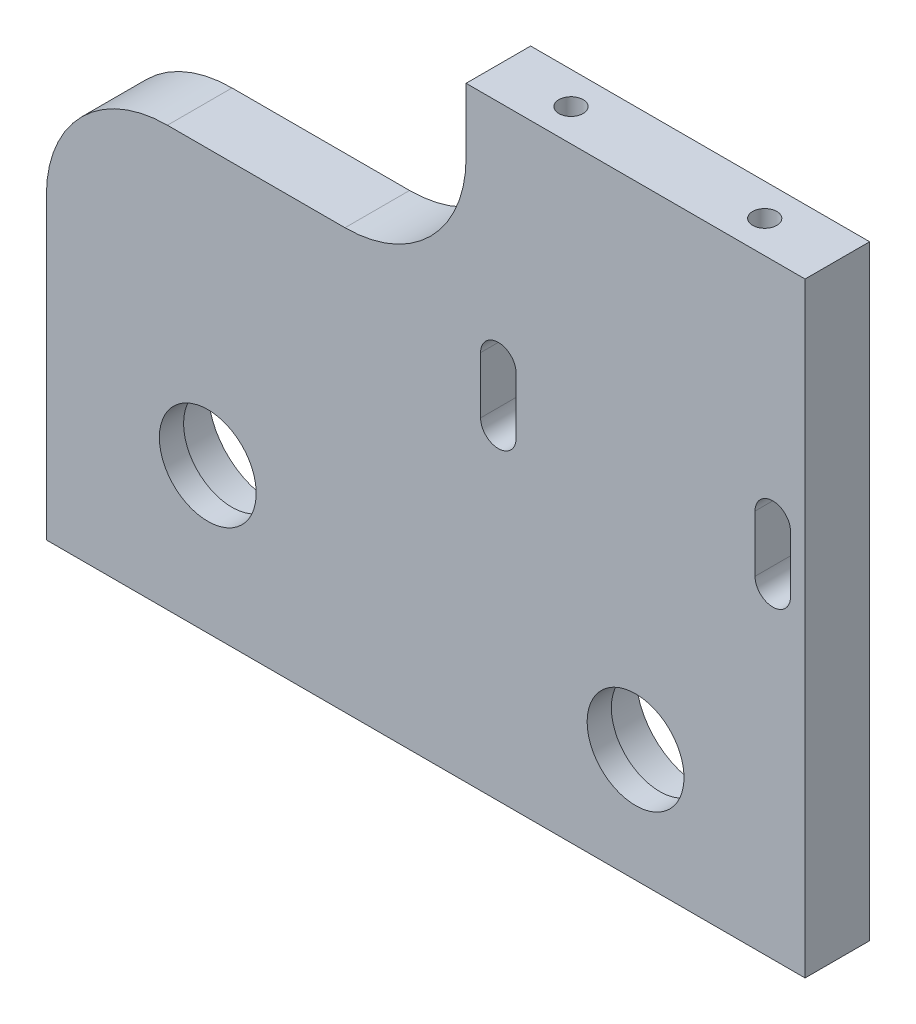
ISO-10303-21;
HEADER;
FILE_DESCRIPTION(('STEP AP214'),'2;1');
FILE_NAME('part.step','',(''),(''),'','','');
FILE_SCHEMA(('AUTOMOTIVE_DESIGN { 1 0 10303 214 1 1 1 1 }'));
ENDSEC;
DATA;
#1=APPLICATION_CONTEXT('core data for automotive mechanical design processes');
#2=APPLICATION_PROTOCOL_DEFINITION('international standard','automotive_design',2000,#1);
#3=PRODUCT_CONTEXT('',#1,'mechanical');
#4=PRODUCT('Part','Part','',(#3));
#5=PRODUCT_RELATED_PRODUCT_CATEGORY('part','',(#4));
#6=PRODUCT_DEFINITION_FORMATION('','',#4);
#7=PRODUCT_DEFINITION_CONTEXT('part definition',#1,'design');
#8=PRODUCT_DEFINITION('design','',#6,#7);
#9=PRODUCT_DEFINITION_SHAPE('','',#8);
#10=(LENGTH_UNIT() NAMED_UNIT(*) SI_UNIT(.MILLI.,.METRE.));
#11=(NAMED_UNIT(*) PLANE_ANGLE_UNIT() SI_UNIT($,.RADIAN.));
#12=(NAMED_UNIT(*) SI_UNIT($,.STERADIAN.) SOLID_ANGLE_UNIT());
#13=UNCERTAINTY_MEASURE_WITH_UNIT(LENGTH_MEASURE(1.E-05),#10,'distance_accuracy_value','');
#14=(GEOMETRIC_REPRESENTATION_CONTEXT(3) GLOBAL_UNCERTAINTY_ASSIGNED_CONTEXT((#13)) GLOBAL_UNIT_ASSIGNED_CONTEXT((#10,
#11,#12)) REPRESENTATION_CONTEXT('',''));
#15=CARTESIAN_POINT('',(0.,0.,0.));
#16=DIRECTION('',(0.,0.,1.));
#17=DIRECTION('',(1.,0.,0.));
#18=AXIS2_PLACEMENT_3D('',#15,#16,#17);
#19=CARTESIAN_POINT('',(0.,0.,8.));
#20=DIRECTION('',(1.,0.,0.));
#21=DIRECTION('',(0.,1.,0.));
#22=AXIS2_PLACEMENT_3D('',#19,#20,#21);
#23=PLANE('',#22);
#24=DIRECTION('',(0.,-1.,0.));
#25=VECTOR('',#24,1.);
#26=CARTESIAN_POINT('',(0.,0.,8.));
#27=LINE('',#26,#25);
#28=CARTESIAN_POINT('',(0.,37.,8.));
#29=VERTEX_POINT('',#28);
#30=CARTESIAN_POINT('',(0.,0.,8.));
#31=VERTEX_POINT('',#30);
#32=EDGE_CURVE('E261',#29,#31,#27,.T.);
#33=ORIENTED_EDGE('',*,*,#32,.F.);
#34=DIRECTION('',(0.,0.,-1.));
#35=VECTOR('',#34,1.);
#36=CARTESIAN_POINT('',(0.,37.,8.));
#37=LINE('',#36,#35);
#38=CARTESIAN_POINT('',(0.,37.,0.));
#39=VERTEX_POINT('',#38);
#40=EDGE_CURVE('E296',#29,#39,#37,.T.);
#41=ORIENTED_EDGE('',*,*,#40,.T.);
#42=DIRECTION('',(0.,-1.,0.));
#43=VECTOR('',#42,1.);
#44=CARTESIAN_POINT('',(0.,0.,0.));
#45=LINE('',#44,#43);
#46=CARTESIAN_POINT('',(0.,0.,0.));
#47=VERTEX_POINT('',#46);
#48=EDGE_CURVE('E252',#39,#47,#45,.T.);
#49=ORIENTED_EDGE('',*,*,#48,.T.);
#50=DIRECTION('',(0.,0.,-1.));
#51=VECTOR('',#50,1.);
#52=CARTESIAN_POINT('',(0.,0.,8.));
#53=LINE('',#52,#51);
#54=EDGE_CURVE('E293',#31,#47,#53,.T.);
#55=ORIENTED_EDGE('',*,*,#54,.F.);
#56=EDGE_LOOP('',(#33,#41,#49,#55));
#57=FACE_BOUND('',#56,.T.);
#58=ADVANCED_FACE('F41',(#57),#23,.F.);
#59=CARTESIAN_POINT('',(0.,0.,8.));
#60=DIRECTION('',(0.,1.,0.));
#61=DIRECTION('',(0.,0.,1.));
#62=AXIS2_PLACEMENT_3D('',#59,#60,#61);
#63=PLANE('',#62);
#64=CARTESIAN_POINT('',(6.00000000000001,0.,4.));
#65=DIRECTION('',(0.,-1.,0.));
#66=DIRECTION('',(0.,0.,-1.));
#67=AXIS2_PLACEMENT_3D('',#64,#65,#66);
#68=CIRCLE('',#67,1.5);
#69=CARTESIAN_POINT('',(6.00000000000001,0.,2.5));
#70=VERTEX_POINT('',#69);
#71=EDGE_CURVE('E585',#70,#70,#68,.T.);
#72=ORIENTED_EDGE('',*,*,#71,.F.);
#73=EDGE_LOOP('',(#72));
#74=FACE_BOUND('',#73,.T.);
#75=CARTESIAN_POINT('',(88.,0.,4.));
#76=DIRECTION('',(0.,-1.,0.));
#77=DIRECTION('',(0.,0.,-1.));
#78=AXIS2_PLACEMENT_3D('',#75,#76,#77);
#79=CIRCLE('',#78,1.5);
#80=CARTESIAN_POINT('',(88.,0.,2.5));
#81=VERTEX_POINT('',#80);
#82=EDGE_CURVE('E595',#81,#81,#79,.T.);
#83=ORIENTED_EDGE('',*,*,#82,.F.);
#84=EDGE_LOOP('',(#83));
#85=FACE_BOUND('',#84,.T.);
#86=DIRECTION('',(1.,0.,0.));
#87=VECTOR('',#86,1.);
#88=CARTESIAN_POINT('',(0.,0.,0.));
#89=LINE('',#88,#87);
#90=CARTESIAN_POINT('',(94.,0.,0.));
#91=VERTEX_POINT('',#90);
#92=EDGE_CURVE('E276',#47,#91,#89,.T.);
#93=ORIENTED_EDGE('',*,*,#92,.T.);
#94=DIRECTION('',(0.,0.,-1.));
#95=VECTOR('',#94,1.);
#96=CARTESIAN_POINT('',(94.,0.,8.));
#97=LINE('',#96,#95);
#98=CARTESIAN_POINT('',(94.,0.,8.));
#99=VERTEX_POINT('',#98);
#100=EDGE_CURVE('E290',#99,#91,#97,.T.);
#101=ORIENTED_EDGE('',*,*,#100,.F.);
#102=DIRECTION('',(1.,0.,0.));
#103=VECTOR('',#102,1.);
#104=CARTESIAN_POINT('',(0.,0.,8.));
#105=LINE('',#104,#103);
#106=EDGE_CURVE('E263',#31,#99,#105,.T.);
#107=ORIENTED_EDGE('',*,*,#106,.F.);
#108=ORIENTED_EDGE('',*,*,#54,.T.);
#109=EDGE_LOOP('',(#93,#101,#107,#108));
#110=FACE_BOUND('',#109,.T.);
#111=ADVANCED_FACE('F330',(#74,#85,#110),#63,.F.);
#112=CARTESIAN_POINT('',(94.,0.,8.));
#113=DIRECTION('',(-1.,0.,0.));
#114=DIRECTION('',(0.,0.,1.));
#115=AXIS2_PLACEMENT_3D('',#112,#113,#114);
#116=PLANE('',#115);
#117=DIRECTION('',(0.,1.,0.));
#118=VECTOR('',#117,1.);
#119=CARTESIAN_POINT('',(94.,0.,0.));
#120=LINE('',#119,#118);
#121=CARTESIAN_POINT('',(94.,75.,0.));
#122=VERTEX_POINT('',#121);
#123=EDGE_CURVE('E278',#91,#122,#120,.T.);
#124=ORIENTED_EDGE('',*,*,#123,.T.);
#125=DIRECTION('',(0.,0.,-1.));
#126=VECTOR('',#125,1.);
#127=CARTESIAN_POINT('',(94.,75.,8.));
#128=LINE('',#127,#126);
#129=CARTESIAN_POINT('',(94.,75.,8.));
#130=VERTEX_POINT('',#129);
#131=EDGE_CURVE('E287',#130,#122,#128,.T.);
#132=ORIENTED_EDGE('',*,*,#131,.F.);
#133=DIRECTION('',(0.,1.,0.));
#134=VECTOR('',#133,1.);
#135=CARTESIAN_POINT('',(94.,0.,8.));
#136=LINE('',#135,#134);
#137=EDGE_CURVE('E266',#99,#130,#136,.T.);
#138=ORIENTED_EDGE('',*,*,#137,.F.);
#139=ORIENTED_EDGE('',*,*,#100,.T.);
#140=EDGE_LOOP('',(#124,#132,#138,#139));
#141=FACE_BOUND('',#140,.T.);
#142=ADVANCED_FACE('F336',(#141),#116,.F.);
#143=CARTESIAN_POINT('',(52.,75.,8.));
#144=DIRECTION('',(0.,-1.,0.));
#145=DIRECTION('',(0.,0.,-1.));
#146=AXIS2_PLACEMENT_3D('',#143,#144,#145);
#147=PLANE('',#146);
#148=CARTESIAN_POINT('',(61.,75.,4.));
#149=DIRECTION('',(0.,1.,0.));
#150=DIRECTION('',(0.,0.,1.));
#151=AXIS2_PLACEMENT_3D('',#148,#149,#150);
#152=CIRCLE('',#151,1.5);
#153=CARTESIAN_POINT('',(61.,75.,5.5));
#154=VERTEX_POINT('',#153);
#155=EDGE_CURVE('E599',#154,#154,#152,.T.);
#156=ORIENTED_EDGE('',*,*,#155,.F.);
#157=EDGE_LOOP('',(#156));
#158=FACE_BOUND('',#157,.T.);
#159=CARTESIAN_POINT('',(85.,75.,4.));
#160=DIRECTION('',(0.,1.,0.));
#161=DIRECTION('',(0.,0.,1.));
#162=AXIS2_PLACEMENT_3D('',#159,#160,#161);
#163=CIRCLE('',#162,1.5);
#164=CARTESIAN_POINT('',(85.,75.,5.5));
#165=VERTEX_POINT('',#164);
#166=EDGE_CURVE('E188',#165,#165,#163,.T.);
#167=ORIENTED_EDGE('',*,*,#166,.F.);
#168=EDGE_LOOP('',(#167));
#169=FACE_BOUND('',#168,.T.);
#170=DIRECTION('',(-1.,0.,0.));
#171=VECTOR('',#170,1.);
#172=CARTESIAN_POINT('',(52.,75.,0.));
#173=LINE('',#172,#171);
#174=CARTESIAN_POINT('',(52.,75.,0.));
#175=VERTEX_POINT('',#174);
#176=EDGE_CURVE('E280',#122,#175,#173,.T.);
#177=ORIENTED_EDGE('',*,*,#176,.T.);
#178=DIRECTION('',(0.,0.,-1.));
#179=VECTOR('',#178,1.);
#180=CARTESIAN_POINT('',(52.,75.,8.));
#181=LINE('',#180,#179);
#182=CARTESIAN_POINT('',(52.,75.,8.));
#183=VERTEX_POINT('',#182);
#184=EDGE_CURVE('E274',#183,#175,#181,.T.);
#185=ORIENTED_EDGE('',*,*,#184,.F.);
#186=DIRECTION('',(-1.,0.,0.));
#187=VECTOR('',#186,1.);
#188=CARTESIAN_POINT('',(52.,75.,8.));
#189=LINE('',#188,#187);
#190=EDGE_CURVE('E268',#130,#183,#189,.T.);
#191=ORIENTED_EDGE('',*,*,#190,.F.);
#192=ORIENTED_EDGE('',*,*,#131,.T.);
#193=EDGE_LOOP('',(#177,#185,#191,#192));
#194=FACE_BOUND('',#193,.T.);
#195=ADVANCED_FACE('F339',(#158,#169,#194),#147,.F.);
#196=CARTESIAN_POINT('',(52.,75.,8.));
#197=DIRECTION('',(1.,0.,0.));
#198=DIRECTION('',(0.,0.,-1.));
#199=AXIS2_PLACEMENT_3D('',#196,#197,#198);
#200=PLANE('',#199);
#201=DIRECTION('',(0.,-1.,0.));
#202=VECTOR('',#201,1.);
#203=CARTESIAN_POINT('',(52.,75.,0.));
#204=LINE('',#203,#202);
#205=CARTESIAN_POINT('',(52.,67.,0.));
#206=VERTEX_POINT('',#205);
#207=EDGE_CURVE('E282',#175,#206,#204,.T.);
#208=ORIENTED_EDGE('',*,*,#207,.T.);
#209=DIRECTION('',(0.,0.,-1.));
#210=VECTOR('',#209,1.);
#211=CARTESIAN_POINT('',(52.,67.,8.));
#212=LINE('',#211,#210);
#213=CARTESIAN_POINT('',(52.,67.,8.));
#214=VERTEX_POINT('',#213);
#215=EDGE_CURVE('E56',#206,#214,#212,.F.);
#216=ORIENTED_EDGE('',*,*,#215,.T.);
#217=DIRECTION('',(0.,-1.,0.));
#218=VECTOR('',#217,1.);
#219=CARTESIAN_POINT('',(52.,75.,8.));
#220=LINE('',#219,#218);
#221=EDGE_CURVE('E270',#183,#214,#220,.T.);
#222=ORIENTED_EDGE('',*,*,#221,.F.);
#223=ORIENTED_EDGE('',*,*,#184,.T.);
#224=EDGE_LOOP('',(#208,#216,#222,#223));
#225=FACE_BOUND('',#224,.T.);
#226=ADVANCED_FACE('F315',(#225),#200,.F.);
#227=CARTESIAN_POINT('',(52.,52.,8.));
#228=DIRECTION('',(0.,-1.,0.));
#229=DIRECTION('',(1.,0.,0.));
#230=AXIS2_PLACEMENT_3D('',#227,#228,#229);
#231=PLANE('',#230);
#232=DIRECTION('',(-1.,0.,0.));
#233=VECTOR('',#232,1.);
#234=CARTESIAN_POINT('',(52.,52.,0.));
#235=LINE('',#234,#233);
#236=CARTESIAN_POINT('',(37.,52.,0.));
#237=VERTEX_POINT('',#236);
#238=CARTESIAN_POINT('',(15.,52.,0.));
#239=VERTEX_POINT('',#238);
#240=EDGE_CURVE('E264',#237,#239,#235,.T.);
#241=ORIENTED_EDGE('',*,*,#240,.T.);
#242=DIRECTION('',(0.,0.,-1.));
#243=VECTOR('',#242,1.);
#244=CARTESIAN_POINT('',(15.,52.,8.));
#245=LINE('',#244,#243);
#246=CARTESIAN_POINT('',(15.,52.,8.));
#247=VERTEX_POINT('',#246);
#248=EDGE_CURVE('E64',#239,#247,#245,.F.);
#249=ORIENTED_EDGE('',*,*,#248,.T.);
#250=DIRECTION('',(-1.,0.,0.));
#251=VECTOR('',#250,1.);
#252=CARTESIAN_POINT('',(52.,52.,8.));
#253=LINE('',#252,#251);
#254=CARTESIAN_POINT('',(37.,52.,8.));
#255=VERTEX_POINT('',#254);
#256=EDGE_CURVE('E272',#255,#247,#253,.T.);
#257=ORIENTED_EDGE('',*,*,#256,.F.);
#258=DIRECTION('',(0.,0.,-1.));
#259=VECTOR('',#258,1.);
#260=CARTESIAN_POINT('',(37.,52.,0.));
#261=LINE('',#260,#259);
#262=EDGE_CURVE('E301',#255,#237,#261,.T.);
#263=ORIENTED_EDGE('',*,*,#262,.T.);
#264=EDGE_LOOP('',(#241,#249,#257,#263));
#265=FACE_BOUND('',#264,.T.);
#266=ADVANCED_FACE('F320',(#265),#231,.F.);
#267=CARTESIAN_POINT('',(0.,0.,8.));
#268=DIRECTION('',(0.,0.,1.));
#269=DIRECTION('',(1.,0.,0.));
#270=AXIS2_PLACEMENT_3D('',#267,#268,#269);
#271=PLANE('',#270);
#272=CARTESIAN_POINT('',(90.,40.,8.));
#273=DIRECTION('',(0.,0.,-1.));
#274=DIRECTION('',(-1.,0.,0.));
#275=AXIS2_PLACEMENT_3D('',#272,#273,#274);
#276=CIRCLE('',#275,2.19999999999999);
#277=CARTESIAN_POINT('',(92.2,40.,8.));
#278=VERTEX_POINT('',#277);
#279=CARTESIAN_POINT('',(87.8,40.,8.));
#280=VERTEX_POINT('',#279);
#281=EDGE_CURVE('E161',#278,#280,#276,.T.);
#282=ORIENTED_EDGE('',*,*,#281,.T.);
#283=DIRECTION('',(0.,1.,0.));
#284=VECTOR('',#283,1.);
#285=CARTESIAN_POINT('',(87.8,40.,8.));
#286=LINE('',#285,#284);
#287=CARTESIAN_POINT('',(87.8,47.,8.));
#288=VERTEX_POINT('',#287);
#289=EDGE_CURVE('E173',#280,#288,#286,.T.);
#290=ORIENTED_EDGE('',*,*,#289,.T.);
#291=CARTESIAN_POINT('',(90.,47.,8.));
#292=DIRECTION('',(0.,0.,-1.));
#293=DIRECTION('',(-1.,0.,0.));
#294=AXIS2_PLACEMENT_3D('',#291,#292,#293);
#295=CIRCLE('',#294,2.19999999999999);
#296=CARTESIAN_POINT('',(92.2,47.,8.));
#297=VERTEX_POINT('',#296);
#298=EDGE_CURVE('E177',#288,#297,#295,.T.);
#299=ORIENTED_EDGE('',*,*,#298,.T.);
#300=DIRECTION('',(0.,-1.,0.));
#301=VECTOR('',#300,1.);
#302=CARTESIAN_POINT('',(92.2,40.,8.));
#303=LINE('',#302,#301);
#304=EDGE_CURVE('E169',#297,#278,#303,.T.);
#305=ORIENTED_EDGE('',*,*,#304,.T.);
#306=EDGE_LOOP('',(#282,#290,#299,#305));
#307=FACE_BOUND('',#306,.T.);
#308=CARTESIAN_POINT('',(56.,40.,8.));
#309=DIRECTION('',(0.,0.,-1.));
#310=DIRECTION('',(1.,0.,0.));
#311=AXIS2_PLACEMENT_3D('',#308,#309,#310);
#312=CIRCLE('',#311,2.19999999999999);
#313=CARTESIAN_POINT('',(58.2,40.,8.));
#314=VERTEX_POINT('',#313);
#315=CARTESIAN_POINT('',(53.8,40.,8.));
#316=VERTEX_POINT('',#315);
#317=EDGE_CURVE('E205',#314,#316,#312,.T.);
#318=ORIENTED_EDGE('',*,*,#317,.T.);
#319=DIRECTION('',(0.,1.,0.));
#320=VECTOR('',#319,1.);
#321=CARTESIAN_POINT('',(53.8,40.,8.));
#322=LINE('',#321,#320);
#323=CARTESIAN_POINT('',(53.8,47.,8.));
#324=VERTEX_POINT('',#323);
#325=EDGE_CURVE('E208',#316,#324,#322,.T.);
#326=ORIENTED_EDGE('',*,*,#325,.T.);
#327=CARTESIAN_POINT('',(56.,47.,8.));
#328=DIRECTION('',(0.,0.,-1.));
#329=DIRECTION('',(1.,0.,0.));
#330=AXIS2_PLACEMENT_3D('',#327,#328,#329);
#331=CIRCLE('',#330,2.19999999999999);
#332=CARTESIAN_POINT('',(58.2,47.,8.));
#333=VERTEX_POINT('',#332);
#334=EDGE_CURVE('E212',#324,#333,#331,.T.);
#335=ORIENTED_EDGE('',*,*,#334,.T.);
#336=DIRECTION('',(0.,-1.,0.));
#337=VECTOR('',#336,1.);
#338=CARTESIAN_POINT('',(58.2,40.,8.));
#339=LINE('',#338,#337);
#340=EDGE_CURVE('E215',#333,#314,#339,.T.);
#341=ORIENTED_EDGE('',*,*,#340,.T.);
#342=EDGE_LOOP('',(#318,#326,#335,#341));
#343=FACE_BOUND('',#342,.T.);
#344=CARTESIAN_POINT('',(73.,14.,8.));
#345=DIRECTION('',(0.,0.,-1.));
#346=DIRECTION('',(-1.,0.,0.));
#347=AXIS2_PLACEMENT_3D('',#344,#345,#346);
#348=CIRCLE('',#347,6.);
#349=CARTESIAN_POINT('',(67.,14.,8.));
#350=VERTEX_POINT('',#349);
#351=EDGE_CURVE('E237',#350,#350,#348,.T.);
#352=ORIENTED_EDGE('',*,*,#351,.T.);
#353=EDGE_LOOP('',(#352));
#354=FACE_BOUND('',#353,.T.);
#355=CARTESIAN_POINT('',(20.,18.,8.));
#356=DIRECTION('',(0.,0.,-1.));
#357=DIRECTION('',(-1.,0.,0.));
#358=AXIS2_PLACEMENT_3D('',#355,#356,#357);
#359=CIRCLE('',#358,6.);
#360=CARTESIAN_POINT('',(14.,18.,8.));
#361=VERTEX_POINT('',#360);
#362=EDGE_CURVE('E244',#361,#361,#359,.T.);
#363=ORIENTED_EDGE('',*,*,#362,.T.);
#364=EDGE_LOOP('',(#363));
#365=FACE_BOUND('',#364,.T.);
#366=ORIENTED_EDGE('',*,*,#256,.T.);
#367=CARTESIAN_POINT('',(15.,37.,8.));
#368=DIRECTION('',(0.,0.,1.));
#369=DIRECTION('',(1.,0.,0.));
#370=AXIS2_PLACEMENT_3D('',#367,#368,#369);
#371=CIRCLE('',#370,15.);
#372=EDGE_CURVE('E305',#247,#29,#371,.T.);
#373=ORIENTED_EDGE('',*,*,#372,.T.);
#374=ORIENTED_EDGE('',*,*,#32,.T.);
#375=ORIENTED_EDGE('',*,*,#106,.T.);
#376=ORIENTED_EDGE('',*,*,#137,.T.);
#377=ORIENTED_EDGE('',*,*,#190,.T.);
#378=ORIENTED_EDGE('',*,*,#221,.T.);
#379=CARTESIAN_POINT('',(37.,67.,8.));
#380=DIRECTION('',(0.,0.,1.));
#381=DIRECTION('',(1.,0.,0.));
#382=AXIS2_PLACEMENT_3D('',#379,#380,#381);
#383=CIRCLE('',#382,15.);
#384=EDGE_CURVE('E11',#214,#255,#383,.F.);
#385=ORIENTED_EDGE('',*,*,#384,.T.);
#386=EDGE_LOOP('',(#366,#373,#374,#375,#376,#377,#378,#385));
#387=FACE_BOUND('',#386,.T.);
#388=ADVANCED_FACE('F179',(#307,#343,#354,#365,#387),#271,.T.);
#389=CARTESIAN_POINT('',(0.,0.,0.));
#390=DIRECTION('',(0.,0.,1.));
#391=DIRECTION('',(1.,0.,0.));
#392=AXIS2_PLACEMENT_3D('',#389,#390,#391);
#393=PLANE('',#392);
#394=DIRECTION('',(0.,1.,0.));
#395=VECTOR('',#394,1.);
#396=CARTESIAN_POINT('',(87.8,40.,0.));
#397=LINE('',#396,#395);
#398=CARTESIAN_POINT('',(87.8,40.,0.));
#399=VERTEX_POINT('',#398);
#400=CARTESIAN_POINT('',(87.8,47.,0.));
#401=VERTEX_POINT('',#400);
#402=EDGE_CURVE('E194',#399,#401,#397,.T.);
#403=ORIENTED_EDGE('',*,*,#402,.F.);
#404=CARTESIAN_POINT('',(90.,40.,0.));
#405=DIRECTION('',(0.,0.,-1.));
#406=DIRECTION('',(-1.,0.,0.));
#407=AXIS2_PLACEMENT_3D('',#404,#405,#406);
#408=CIRCLE('',#407,2.19999999999999);
#409=CARTESIAN_POINT('',(92.2,40.,0.));
#410=VERTEX_POINT('',#409);
#411=EDGE_CURVE('E164',#410,#399,#408,.T.);
#412=ORIENTED_EDGE('',*,*,#411,.F.);
#413=DIRECTION('',(0.,-1.,0.));
#414=VECTOR('',#413,1.);
#415=CARTESIAN_POINT('',(92.2,40.,0.));
#416=LINE('',#415,#414);
#417=CARTESIAN_POINT('',(92.2,47.,0.));
#418=VERTEX_POINT('',#417);
#419=EDGE_CURVE('E182',#418,#410,#416,.T.);
#420=ORIENTED_EDGE('',*,*,#419,.F.);
#421=CARTESIAN_POINT('',(90.,47.,0.));
#422=DIRECTION('',(0.,0.,-1.));
#423=DIRECTION('',(-1.,0.,0.));
#424=AXIS2_PLACEMENT_3D('',#421,#422,#423);
#425=CIRCLE('',#424,2.19999999999999);
#426=EDGE_CURVE('E185',#401,#418,#425,.T.);
#427=ORIENTED_EDGE('',*,*,#426,.F.);
#428=EDGE_LOOP('',(#403,#412,#420,#427));
#429=FACE_BOUND('',#428,.T.);
#430=DIRECTION('',(0.,1.,0.));
#431=VECTOR('',#430,1.);
#432=CARTESIAN_POINT('',(53.8,40.,0.));
#433=LINE('',#432,#431);
#434=CARTESIAN_POINT('',(53.8,40.,0.));
#435=VERTEX_POINT('',#434);
#436=CARTESIAN_POINT('',(53.8,47.,0.));
#437=VERTEX_POINT('',#436);
#438=EDGE_CURVE('E221',#435,#437,#433,.T.);
#439=ORIENTED_EDGE('',*,*,#438,.F.);
#440=CARTESIAN_POINT('',(56.,40.,0.));
#441=DIRECTION('',(0.,0.,-1.));
#442=DIRECTION('',(1.,0.,0.));
#443=AXIS2_PLACEMENT_3D('',#440,#441,#442);
#444=CIRCLE('',#443,2.19999999999999);
#445=CARTESIAN_POINT('',(58.2,40.,0.));
#446=VERTEX_POINT('',#445);
#447=EDGE_CURVE('E219',#446,#435,#444,.T.);
#448=ORIENTED_EDGE('',*,*,#447,.F.);
#449=DIRECTION('',(0.,-1.,0.));
#450=VECTOR('',#449,1.);
#451=CARTESIAN_POINT('',(58.2,40.,0.));
#452=LINE('',#451,#450);
#453=CARTESIAN_POINT('',(58.2,47.,0.));
#454=VERTEX_POINT('',#453);
#455=EDGE_CURVE('E209',#454,#446,#452,.T.);
#456=ORIENTED_EDGE('',*,*,#455,.F.);
#457=CARTESIAN_POINT('',(56.,47.,0.));
#458=DIRECTION('',(0.,0.,-1.));
#459=DIRECTION('',(1.,0.,0.));
#460=AXIS2_PLACEMENT_3D('',#457,#458,#459);
#461=CIRCLE('',#460,2.19999999999999);
#462=EDGE_CURVE('E225',#437,#454,#461,.T.);
#463=ORIENTED_EDGE('',*,*,#462,.F.);
#464=EDGE_LOOP('',(#439,#448,#456,#463));
#465=FACE_BOUND('',#464,.T.);
#466=CARTESIAN_POINT('',(20.,18.,0.));
#467=DIRECTION('',(0.,0.,-1.));
#468=DIRECTION('',(-1.,0.,0.));
#469=AXIS2_PLACEMENT_3D('',#466,#467,#468);
#470=CIRCLE('',#469,7.95);
#471=CARTESIAN_POINT('',(12.05,18.,0.));
#472=VERTEX_POINT('',#471);
#473=EDGE_CURVE('E253',#472,#472,#470,.T.);
#474=ORIENTED_EDGE('',*,*,#473,.F.);
#475=EDGE_LOOP('',(#474));
#476=FACE_BOUND('',#475,.T.);
#477=CARTESIAN_POINT('',(73.,14.,0.));
#478=DIRECTION('',(0.,0.,-1.));
#479=DIRECTION('',(-1.,0.,0.));
#480=AXIS2_PLACEMENT_3D('',#477,#478,#479);
#481=CIRCLE('',#480,7.95);
#482=CARTESIAN_POINT('',(65.05,14.,0.));
#483=VERTEX_POINT('',#482);
#484=EDGE_CURVE('E240',#483,#483,#481,.T.);
#485=ORIENTED_EDGE('',*,*,#484,.F.);
#486=EDGE_LOOP('',(#485));
#487=FACE_BOUND('',#486,.T.);
#488=ORIENTED_EDGE('',*,*,#48,.F.);
#489=CARTESIAN_POINT('',(15.,37.,0.));
#490=DIRECTION('',(0.,0.,1.));
#491=DIRECTION('',(1.,0.,0.));
#492=AXIS2_PLACEMENT_3D('',#489,#490,#491);
#493=CIRCLE('',#492,15.);
#494=EDGE_CURVE('E299',#39,#239,#493,.F.);
#495=ORIENTED_EDGE('',*,*,#494,.T.);
#496=ORIENTED_EDGE('',*,*,#240,.F.);
#497=CARTESIAN_POINT('',(37.,67.,0.));
#498=DIRECTION('',(0.,0.,1.));
#499=DIRECTION('',(1.,0.,0.));
#500=AXIS2_PLACEMENT_3D('',#497,#498,#499);
#501=CIRCLE('',#500,15.);
#502=EDGE_CURVE('E49',#237,#206,#501,.T.);
#503=ORIENTED_EDGE('',*,*,#502,.T.);
#504=ORIENTED_EDGE('',*,*,#207,.F.);
#505=ORIENTED_EDGE('',*,*,#176,.F.);
#506=ORIENTED_EDGE('',*,*,#123,.F.);
#507=ORIENTED_EDGE('',*,*,#92,.F.);
#508=EDGE_LOOP('',(#488,#495,#496,#503,#504,#505,#506,#507));
#509=FACE_BOUND('',#508,.T.);
#510=ADVANCED_FACE('F311',(#429,#465,#476,#487,#509),#393,.F.);
#511=CARTESIAN_POINT('',(73.,14.,5.));
#512=DIRECTION('',(0.,0.,-1.));
#513=DIRECTION('',(-1.,0.,0.));
#514=AXIS2_PLACEMENT_3D('',#511,#512,#513);
#515=CYLINDRICAL_SURFACE('',#514,7.95);
#516=CARTESIAN_POINT('',(73.,14.,5.));
#517=DIRECTION('',(0.,0.,-1.));
#518=DIRECTION('',(-1.,0.,0.));
#519=AXIS2_PLACEMENT_3D('',#516,#517,#518);
#520=CIRCLE('',#519,7.95);
#521=CARTESIAN_POINT('',(65.05,14.,5.));
#522=VERTEX_POINT('',#521);
#523=EDGE_CURVE('E256',#522,#522,#520,.T.);
#524=ORIENTED_EDGE('',*,*,#523,.F.);
#525=EDGE_LOOP('',(#524));
#526=FACE_BOUND('',#525,.T.);
#527=ORIENTED_EDGE('',*,*,#484,.T.);
#528=EDGE_LOOP('',(#527));
#529=FACE_BOUND('',#528,.T.);
#530=ADVANCED_FACE('F433',(#526,#529),#515,.F.);
#531=CARTESIAN_POINT('',(73.,14.,5.));
#532=DIRECTION('',(0.,0.,-1.));
#533=DIRECTION('',(-1.,0.,0.));
#534=AXIS2_PLACEMENT_3D('',#531,#532,#533);
#535=PLANE('',#534);
#536=CARTESIAN_POINT('',(73.,14.,5.));
#537=DIRECTION('',(0.,0.,-1.));
#538=DIRECTION('',(-1.,0.,0.));
#539=AXIS2_PLACEMENT_3D('',#536,#537,#538);
#540=CIRCLE('',#539,6.);
#541=CARTESIAN_POINT('',(67.,14.,5.));
#542=VERTEX_POINT('',#541);
#543=EDGE_CURVE('E241',#542,#542,#540,.T.);
#544=ORIENTED_EDGE('',*,*,#543,.F.);
#545=EDGE_LOOP('',(#544));
#546=FACE_BOUND('',#545,.T.);
#547=ORIENTED_EDGE('',*,*,#523,.T.);
#548=EDGE_LOOP('',(#547));
#549=FACE_BOUND('',#548,.T.);
#550=ADVANCED_FACE('F429',(#546,#549),#535,.T.);
#551=CARTESIAN_POINT('',(20.,18.,5.));
#552=DIRECTION('',(0.,0.,-1.));
#553=DIRECTION('',(-1.,0.,0.));
#554=AXIS2_PLACEMENT_3D('',#551,#552,#553);
#555=CYLINDRICAL_SURFACE('',#554,7.95);
#556=CARTESIAN_POINT('',(20.,18.,5.));
#557=DIRECTION('',(0.,0.,-1.));
#558=DIRECTION('',(-1.,0.,0.));
#559=AXIS2_PLACEMENT_3D('',#556,#557,#558);
#560=CIRCLE('',#559,7.95);
#561=CARTESIAN_POINT('',(12.05,18.,5.));
#562=VERTEX_POINT('',#561);
#563=EDGE_CURVE('E249',#562,#562,#560,.T.);
#564=ORIENTED_EDGE('',*,*,#563,.F.);
#565=EDGE_LOOP('',(#564));
#566=FACE_BOUND('',#565,.T.);
#567=ORIENTED_EDGE('',*,*,#473,.T.);
#568=EDGE_LOOP('',(#567));
#569=FACE_BOUND('',#568,.T.);
#570=ADVANCED_FACE('F425',(#566,#569),#555,.F.);
#571=CARTESIAN_POINT('',(20.,18.,5.));
#572=DIRECTION('',(0.,0.,-1.));
#573=DIRECTION('',(-1.,0.,0.));
#574=AXIS2_PLACEMENT_3D('',#571,#572,#573);
#575=PLANE('',#574);
#576=CARTESIAN_POINT('',(20.,18.,5.));
#577=DIRECTION('',(0.,0.,-1.));
#578=DIRECTION('',(-1.,0.,0.));
#579=AXIS2_PLACEMENT_3D('',#576,#577,#578);
#580=CIRCLE('',#579,6.);
#581=CARTESIAN_POINT('',(14.,18.,5.));
#582=VERTEX_POINT('',#581);
#583=EDGE_CURVE('E201',#582,#582,#580,.T.);
#584=ORIENTED_EDGE('',*,*,#583,.F.);
#585=EDGE_LOOP('',(#584));
#586=FACE_BOUND('',#585,.T.);
#587=ORIENTED_EDGE('',*,*,#563,.T.);
#588=EDGE_LOOP('',(#587));
#589=FACE_BOUND('',#588,.T.);
#590=ADVANCED_FACE('F421',(#586,#589),#575,.T.);
#591=CARTESIAN_POINT('',(20.,18.,8.));
#592=DIRECTION('',(0.,0.,-1.));
#593=DIRECTION('',(-1.,0.,0.));
#594=AXIS2_PLACEMENT_3D('',#591,#592,#593);
#595=CYLINDRICAL_SURFACE('',#594,6.);
#596=ORIENTED_EDGE('',*,*,#362,.F.);
#597=EDGE_LOOP('',(#596));
#598=FACE_BOUND('',#597,.T.);
#599=ORIENTED_EDGE('',*,*,#583,.T.);
#600=EDGE_LOOP('',(#599));
#601=FACE_BOUND('',#600,.T.);
#602=ADVANCED_FACE('F417',(#598,#601),#595,.F.);
#603=CARTESIAN_POINT('',(73.,14.,8.));
#604=DIRECTION('',(0.,0.,-1.));
#605=DIRECTION('',(-1.,0.,0.));
#606=AXIS2_PLACEMENT_3D('',#603,#604,#605);
#607=CYLINDRICAL_SURFACE('',#606,6.);
#608=ORIENTED_EDGE('',*,*,#351,.F.);
#609=EDGE_LOOP('',(#608));
#610=FACE_BOUND('',#609,.T.);
#611=ORIENTED_EDGE('',*,*,#543,.T.);
#612=EDGE_LOOP('',(#611));
#613=FACE_BOUND('',#612,.T.);
#614=ADVANCED_FACE('F413',(#610,#613),#607,.F.);
#615=CARTESIAN_POINT('',(56.,40.,8.));
#616=DIRECTION('',(0.,0.,-1.));
#617=DIRECTION('',(-1.,0.,0.));
#618=AXIS2_PLACEMENT_3D('',#615,#616,#617);
#619=CYLINDRICAL_SURFACE('',#618,2.19999999999999);
#620=ORIENTED_EDGE('',*,*,#447,.T.);
#621=DIRECTION('',(0.,0.,-1.));
#622=VECTOR('',#621,1.);
#623=CARTESIAN_POINT('',(53.8,40.,8.));
#624=LINE('',#623,#622);
#625=EDGE_CURVE('E218',#316,#435,#624,.T.);
#626=ORIENTED_EDGE('',*,*,#625,.F.);
#627=ORIENTED_EDGE('',*,*,#317,.F.);
#628=DIRECTION('',(0.,0.,-1.));
#629=VECTOR('',#628,1.);
#630=CARTESIAN_POINT('',(58.2,40.,8.));
#631=LINE('',#630,#629);
#632=EDGE_CURVE('E195',#314,#446,#631,.T.);
#633=ORIENTED_EDGE('',*,*,#632,.T.);
#634=EDGE_LOOP('',(#620,#626,#627,#633));
#635=FACE_BOUND('',#634,.T.);
#636=ADVANCED_FACE('F403',(#635),#619,.F.);
#637=CARTESIAN_POINT('',(58.2,40.,8.));
#638=DIRECTION('',(1.,0.,0.));
#639=DIRECTION('',(0.,0.,-1.));
#640=AXIS2_PLACEMENT_3D('',#637,#638,#639);
#641=PLANE('',#640);
#642=ORIENTED_EDGE('',*,*,#455,.T.);
#643=ORIENTED_EDGE('',*,*,#632,.F.);
#644=ORIENTED_EDGE('',*,*,#340,.F.);
#645=DIRECTION('',(0.,0.,-1.));
#646=VECTOR('',#645,1.);
#647=CARTESIAN_POINT('',(58.2,47.,8.));
#648=LINE('',#647,#646);
#649=EDGE_CURVE('E231',#333,#454,#648,.T.);
#650=ORIENTED_EDGE('',*,*,#649,.T.);
#651=EDGE_LOOP('',(#642,#643,#644,#650));
#652=FACE_BOUND('',#651,.T.);
#653=ADVANCED_FACE('F399',(#652),#641,.F.);
#654=CARTESIAN_POINT('',(56.,47.,8.));
#655=DIRECTION('',(0.,0.,-1.));
#656=DIRECTION('',(-1.,0.,0.));
#657=AXIS2_PLACEMENT_3D('',#654,#655,#656);
#658=CYLINDRICAL_SURFACE('',#657,2.19999999999999);
#659=ORIENTED_EDGE('',*,*,#462,.T.);
#660=ORIENTED_EDGE('',*,*,#649,.F.);
#661=ORIENTED_EDGE('',*,*,#334,.F.);
#662=DIRECTION('',(0.,0.,-1.));
#663=VECTOR('',#662,1.);
#664=CARTESIAN_POINT('',(53.8,47.,8.));
#665=LINE('',#664,#663);
#666=EDGE_CURVE('E233',#324,#437,#665,.T.);
#667=ORIENTED_EDGE('',*,*,#666,.T.);
#668=EDGE_LOOP('',(#659,#660,#661,#667));
#669=FACE_BOUND('',#668,.T.);
#670=ADVANCED_FACE('F402',(#669),#658,.F.);
#671=CARTESIAN_POINT('',(53.8,40.,8.));
#672=DIRECTION('',(-1.,0.,0.));
#673=DIRECTION('',(0.,0.,1.));
#674=AXIS2_PLACEMENT_3D('',#671,#672,#673);
#675=PLANE('',#674);
#676=ORIENTED_EDGE('',*,*,#438,.T.);
#677=ORIENTED_EDGE('',*,*,#666,.F.);
#678=ORIENTED_EDGE('',*,*,#325,.F.);
#679=ORIENTED_EDGE('',*,*,#625,.T.);
#680=EDGE_LOOP('',(#676,#677,#678,#679));
#681=FACE_BOUND('',#680,.T.);
#682=ADVANCED_FACE('F398',(#681),#675,.F.);
#683=CARTESIAN_POINT('',(90.,40.,8.));
#684=DIRECTION('',(0.,0.,-1.));
#685=DIRECTION('',(-1.,0.,0.));
#686=AXIS2_PLACEMENT_3D('',#683,#684,#685);
#687=CYLINDRICAL_SURFACE('',#686,2.19999999999999);
#688=ORIENTED_EDGE('',*,*,#411,.T.);
#689=DIRECTION('',(0.,0.,-1.));
#690=VECTOR('',#689,1.);
#691=CARTESIAN_POINT('',(87.8,40.,8.));
#692=LINE('',#691,#690);
#693=EDGE_CURVE('E157',#280,#399,#692,.T.);
#694=ORIENTED_EDGE('',*,*,#693,.F.);
#695=ORIENTED_EDGE('',*,*,#281,.F.);
#696=DIRECTION('',(0.,0.,-1.));
#697=VECTOR('',#696,1.);
#698=CARTESIAN_POINT('',(92.2,40.,8.));
#699=LINE('',#698,#697);
#700=EDGE_CURVE('E199',#278,#410,#699,.T.);
#701=ORIENTED_EDGE('',*,*,#700,.T.);
#702=EDGE_LOOP('',(#688,#694,#695,#701));
#703=FACE_BOUND('',#702,.T.);
#704=ADVANCED_FACE('F159',(#703),#687,.F.);
#705=CARTESIAN_POINT('',(92.2,40.,8.));
#706=DIRECTION('',(1.,0.,0.));
#707=DIRECTION('',(0.,0.,-1.));
#708=AXIS2_PLACEMENT_3D('',#705,#706,#707);
#709=PLANE('',#708);
#710=ORIENTED_EDGE('',*,*,#419,.T.);
#711=ORIENTED_EDGE('',*,*,#700,.F.);
#712=ORIENTED_EDGE('',*,*,#304,.F.);
#713=DIRECTION('',(0.,0.,-1.));
#714=VECTOR('',#713,1.);
#715=CARTESIAN_POINT('',(92.2,47.,8.));
#716=LINE('',#715,#714);
#717=EDGE_CURVE('E202',#297,#418,#716,.T.);
#718=ORIENTED_EDGE('',*,*,#717,.T.);
#719=EDGE_LOOP('',(#710,#711,#712,#718));
#720=FACE_BOUND('',#719,.T.);
#721=ADVANCED_FACE('F387',(#720),#709,.F.);
#722=CARTESIAN_POINT('',(90.,47.,8.));
#723=DIRECTION('',(0.,0.,-1.));
#724=DIRECTION('',(-1.,0.,0.));
#725=AXIS2_PLACEMENT_3D('',#722,#723,#724);
#726=CYLINDRICAL_SURFACE('',#725,2.19999999999999);
#727=ORIENTED_EDGE('',*,*,#426,.T.);
#728=ORIENTED_EDGE('',*,*,#717,.F.);
#729=ORIENTED_EDGE('',*,*,#298,.F.);
#730=DIRECTION('',(0.,0.,-1.));
#731=VECTOR('',#730,1.);
#732=CARTESIAN_POINT('',(87.8,47.,8.));
#733=LINE('',#732,#731);
#734=EDGE_CURVE('E168',#288,#401,#733,.T.);
#735=ORIENTED_EDGE('',*,*,#734,.T.);
#736=EDGE_LOOP('',(#727,#728,#729,#735));
#737=FACE_BOUND('',#736,.T.);
#738=ADVANCED_FACE('F390',(#737),#726,.F.);
#739=CARTESIAN_POINT('',(87.8,40.,8.));
#740=DIRECTION('',(-1.,0.,0.));
#741=DIRECTION('',(0.,0.,1.));
#742=AXIS2_PLACEMENT_3D('',#739,#740,#741);
#743=PLANE('',#742);
#744=ORIENTED_EDGE('',*,*,#402,.T.);
#745=ORIENTED_EDGE('',*,*,#734,.F.);
#746=ORIENTED_EDGE('',*,*,#289,.F.);
#747=ORIENTED_EDGE('',*,*,#693,.T.);
#748=EDGE_LOOP('',(#744,#745,#746,#747));
#749=FACE_BOUND('',#748,.T.);
#750=ADVANCED_FACE('F174',(#749),#743,.F.);
#751=CARTESIAN_POINT('',(85.,45.,4.));
#752=DIRECTION('',(0.,1.,0.));
#753=DIRECTION('',(0.,0.,1.));
#754=AXIS2_PLACEMENT_3D('',#751,#752,#753);
#755=CYLINDRICAL_SURFACE('',#754,1.5);
#756=CARTESIAN_POINT('',(85.,45.,4.));
#757=DIRECTION('',(0.,1.,0.));
#758=DIRECTION('',(0.,0.,1.));
#759=AXIS2_PLACEMENT_3D('',#756,#757,#758);
#760=CIRCLE('',#759,1.5);
#761=CARTESIAN_POINT('',(85.,45.,5.5));
#762=VERTEX_POINT('',#761);
#763=EDGE_CURVE('E588',#762,#762,#760,.T.);
#764=ORIENTED_EDGE('',*,*,#763,.F.);
#765=EDGE_LOOP('',(#764));
#766=FACE_BOUND('',#765,.T.);
#767=ORIENTED_EDGE('',*,*,#166,.T.);
#768=EDGE_LOOP('',(#767));
#769=FACE_BOUND('',#768,.T.);
#770=ADVANCED_FACE('F383',(#766,#769),#755,.F.);
#771=CARTESIAN_POINT('',(85.,45.,4.));
#772=DIRECTION('',(0.,1.,0.));
#773=DIRECTION('',(0.,0.,1.));
#774=AXIS2_PLACEMENT_3D('',#771,#772,#773);
#775=PLANE('',#774);
#776=ORIENTED_EDGE('',*,*,#763,.T.);
#777=EDGE_LOOP('',(#776));
#778=FACE_BOUND('',#777,.T.);
#779=ADVANCED_FACE('F374',(#778),#775,.T.);
#780=CARTESIAN_POINT('',(61.,45.,4.));
#781=DIRECTION('',(0.,1.,0.));
#782=DIRECTION('',(0.,0.,1.));
#783=AXIS2_PLACEMENT_3D('',#780,#781,#782);
#784=CYLINDRICAL_SURFACE('',#783,1.5);
#785=CARTESIAN_POINT('',(61.,45.,4.));
#786=DIRECTION('',(0.,1.,0.));
#787=DIRECTION('',(0.,0.,1.));
#788=AXIS2_PLACEMENT_3D('',#785,#786,#787);
#789=CIRCLE('',#788,1.5);
#790=CARTESIAN_POINT('',(61.,45.,5.5));
#791=VERTEX_POINT('',#790);
#792=EDGE_CURVE('E222',#791,#791,#789,.T.);
#793=ORIENTED_EDGE('',*,*,#792,.F.);
#794=EDGE_LOOP('',(#793));
#795=FACE_BOUND('',#794,.T.);
#796=ORIENTED_EDGE('',*,*,#155,.T.);
#797=EDGE_LOOP('',(#796));
#798=FACE_BOUND('',#797,.T.);
#799=ADVANCED_FACE('F368',(#795,#798),#784,.F.);
#800=CARTESIAN_POINT('',(61.,45.,4.));
#801=DIRECTION('',(0.,1.,0.));
#802=DIRECTION('',(0.,0.,1.));
#803=AXIS2_PLACEMENT_3D('',#800,#801,#802);
#804=PLANE('',#803);
#805=ORIENTED_EDGE('',*,*,#792,.T.);
#806=EDGE_LOOP('',(#805));
#807=FACE_BOUND('',#806,.T.);
#808=ADVANCED_FACE('F362',(#807),#804,.T.);
#809=CARTESIAN_POINT('',(15.,37.,8.));
#810=DIRECTION('',(0.,0.,-1.));
#811=DIRECTION('',(-1.,0.,0.));
#812=AXIS2_PLACEMENT_3D('',#809,#810,#811);
#813=CYLINDRICAL_SURFACE('',#812,15.);
#814=ORIENTED_EDGE('',*,*,#372,.F.);
#815=ORIENTED_EDGE('',*,*,#248,.F.);
#816=ORIENTED_EDGE('',*,*,#494,.F.);
#817=ORIENTED_EDGE('',*,*,#40,.F.);
#818=EDGE_LOOP('',(#814,#815,#816,#817));
#819=FACE_BOUND('',#818,.T.);
#820=ADVANCED_FACE('F322',(#819),#813,.T.);
#821=CARTESIAN_POINT('',(37.,67.,8.));
#822=DIRECTION('',(0.,0.,1.));
#823=DIRECTION('',(1.,0.,0.));
#824=AXIS2_PLACEMENT_3D('',#821,#822,#823);
#825=CYLINDRICAL_SURFACE('',#824,15.);
#826=ORIENTED_EDGE('',*,*,#384,.F.);
#827=ORIENTED_EDGE('',*,*,#215,.F.);
#828=ORIENTED_EDGE('',*,*,#502,.F.);
#829=ORIENTED_EDGE('',*,*,#262,.F.);
#830=EDGE_LOOP('',(#826,#827,#828,#829));
#831=FACE_BOUND('',#830,.T.);
#832=ADVANCED_FACE('F43',(#831),#825,.F.);
#833=CARTESIAN_POINT('',(88.,20.,4.));
#834=DIRECTION('',(0.,-1.,0.));
#835=DIRECTION('',(0.,0.,-1.));
#836=AXIS2_PLACEMENT_3D('',#833,#834,#835);
#837=CYLINDRICAL_SURFACE('',#836,1.5);
#838=CARTESIAN_POINT('',(88.,20.,4.));
#839=DIRECTION('',(0.,-1.,0.));
#840=DIRECTION('',(0.,0.,-1.));
#841=AXIS2_PLACEMENT_3D('',#838,#839,#840);
#842=CIRCLE('',#841,1.5);
#843=CARTESIAN_POINT('',(88.,20.,2.5));
#844=VERTEX_POINT('',#843);
#845=EDGE_CURVE('E590',#844,#844,#842,.T.);
#846=ORIENTED_EDGE('',*,*,#845,.F.);
#847=EDGE_LOOP('',(#846));
#848=FACE_BOUND('',#847,.T.);
#849=ORIENTED_EDGE('',*,*,#82,.T.);
#850=EDGE_LOOP('',(#849));
#851=FACE_BOUND('',#850,.T.);
#852=ADVANCED_FACE('F367',(#848,#851),#837,.F.);
#853=CARTESIAN_POINT('',(88.,20.,4.));
#854=DIRECTION('',(0.,-1.,0.));
#855=DIRECTION('',(0.,0.,-1.));
#856=AXIS2_PLACEMENT_3D('',#853,#854,#855);
#857=PLANE('',#856);
#858=ORIENTED_EDGE('',*,*,#845,.T.);
#859=EDGE_LOOP('',(#858));
#860=FACE_BOUND('',#859,.T.);
#861=ADVANCED_FACE('F551',(#860),#857,.T.);
#862=CARTESIAN_POINT('',(6.00000000000001,20.,4.));
#863=DIRECTION('',(0.,-1.,0.));
#864=DIRECTION('',(0.,0.,-1.));
#865=AXIS2_PLACEMENT_3D('',#862,#863,#864);
#866=CYLINDRICAL_SURFACE('',#865,1.5);
#867=CARTESIAN_POINT('',(6.00000000000001,20.,4.));
#868=DIRECTION('',(0.,-1.,0.));
#869=DIRECTION('',(0.,0.,-1.));
#870=AXIS2_PLACEMENT_3D('',#867,#868,#869);
#871=CIRCLE('',#870,1.5);
#872=CARTESIAN_POINT('',(6.00000000000001,20.,2.5));
#873=VERTEX_POINT('',#872);
#874=EDGE_CURVE('E584',#873,#873,#871,.T.);
#875=ORIENTED_EDGE('',*,*,#874,.F.);
#876=EDGE_LOOP('',(#875));
#877=FACE_BOUND('',#876,.T.);
#878=ORIENTED_EDGE('',*,*,#71,.T.);
#879=EDGE_LOOP('',(#878));
#880=FACE_BOUND('',#879,.T.);
#881=ADVANCED_FACE('F560',(#877,#880),#866,.F.);
#882=CARTESIAN_POINT('',(6.00000000000001,20.,4.));
#883=DIRECTION('',(0.,-1.,0.));
#884=DIRECTION('',(0.,0.,-1.));
#885=AXIS2_PLACEMENT_3D('',#882,#883,#884);
#886=PLANE('',#885);
#887=ORIENTED_EDGE('',*,*,#874,.T.);
#888=EDGE_LOOP('',(#887));
#889=FACE_BOUND('',#888,.T.);
#890=ADVANCED_FACE('F569',(#889),#886,.T.);
#891=CLOSED_SHELL('',(#58,#111,#142,#195,#226,#266,#388,#510,#530,#550,#570,#590,#602,#614,#636,
#653,#670,#682,#704,#721,#738,#750,#770,#779,#799,#808,#820,#832,#852,#861,#881,#890));
#892=MANIFOLD_SOLID_BREP('B2',#891);
#893=ADVANCED_BREP_SHAPE_REPRESENTATION('',(#18,#892),#14);
#894=SHAPE_DEFINITION_REPRESENTATION(#9,#893);
ENDSEC;
END-ISO-10303-21;
